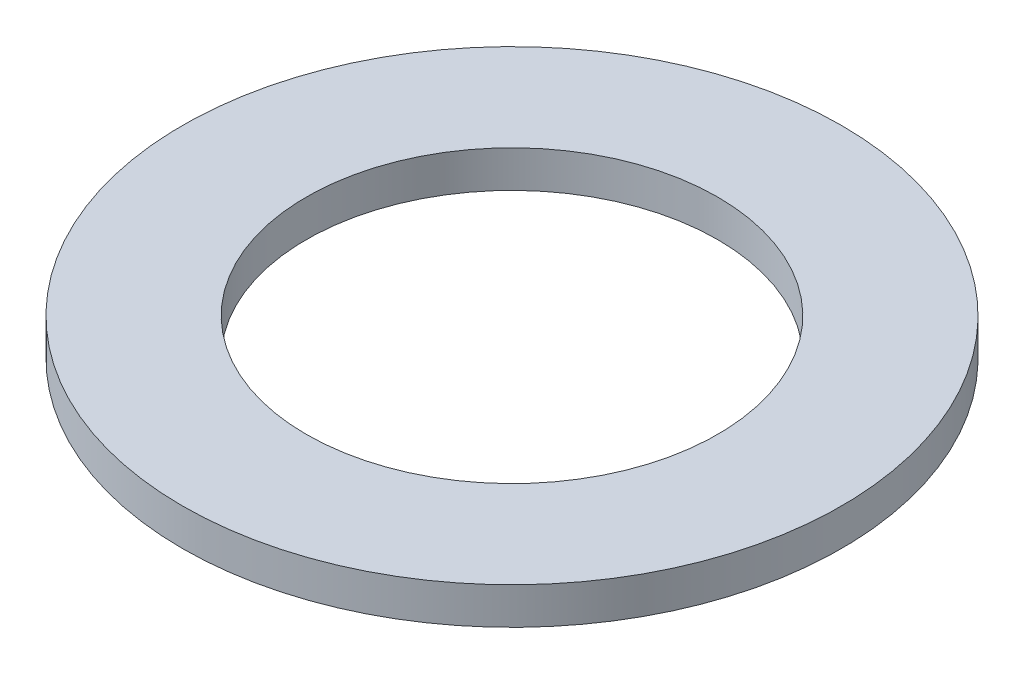
ISO-10303-21;
HEADER;
FILE_DESCRIPTION(('STEP AP214'),'2;1');
FILE_NAME('part.step','',(''),(''),'','','');
FILE_SCHEMA(('AUTOMOTIVE_DESIGN { 1 0 10303 214 1 1 1 1 }'));
ENDSEC;
DATA;
#1=APPLICATION_CONTEXT('core data for automotive mechanical design processes');
#2=APPLICATION_PROTOCOL_DEFINITION('international standard','automotive_design',2000,#1);
#3=PRODUCT_CONTEXT('',#1,'mechanical');
#4=PRODUCT('Part','Part','',(#3));
#5=PRODUCT_RELATED_PRODUCT_CATEGORY('part','',(#4));
#6=PRODUCT_DEFINITION_FORMATION('','',#4);
#7=PRODUCT_DEFINITION_CONTEXT('part definition',#1,'design');
#8=PRODUCT_DEFINITION('design','',#6,#7);
#9=PRODUCT_DEFINITION_SHAPE('','',#8);
#10=(LENGTH_UNIT() NAMED_UNIT(*) SI_UNIT(.MILLI.,.METRE.));
#11=(NAMED_UNIT(*) PLANE_ANGLE_UNIT() SI_UNIT($,.RADIAN.));
#12=(NAMED_UNIT(*) SI_UNIT($,.STERADIAN.) SOLID_ANGLE_UNIT());
#13=UNCERTAINTY_MEASURE_WITH_UNIT(LENGTH_MEASURE(1.E-05),#10,'distance_accuracy_value','');
#14=(GEOMETRIC_REPRESENTATION_CONTEXT(3) GLOBAL_UNCERTAINTY_ASSIGNED_CONTEXT((#13)) GLOBAL_UNIT_ASSIGNED_CONTEXT((#10,
#11,#12)) REPRESENTATION_CONTEXT('',''));
#15=CARTESIAN_POINT('',(0.,0.,0.));
#16=DIRECTION('',(0.,0.,1.));
#17=DIRECTION('',(1.,0.,0.));
#18=AXIS2_PLACEMENT_3D('',#15,#16,#17);
#19=CARTESIAN_POINT('',(0.,0.889,0.));
#20=DIRECTION('',(0.,-1.,0.));
#21=DIRECTION('',(0.,0.,-1.));
#22=AXIS2_PLACEMENT_3D('',#19,#20,#21);
#23=CYLINDRICAL_SURFACE('',#22,7.9375);
#24=CARTESIAN_POINT('',(0.,0.889,0.));
#25=DIRECTION('',(0.,1.,0.));
#26=DIRECTION('',(0.,0.,1.));
#27=AXIS2_PLACEMENT_3D('',#24,#25,#26);
#28=CIRCLE('',#27,7.9375);
#29=CARTESIAN_POINT('',(0.,0.889,7.9375));
#30=VERTEX_POINT('',#29);
#31=EDGE_CURVE('E10',#30,#30,#28,.T.);
#32=ORIENTED_EDGE('',*,*,#31,.F.);
#33=EDGE_LOOP('',(#32));
#34=FACE_BOUND('',#33,.T.);
#35=CARTESIAN_POINT('',(0.,0.,0.));
#36=DIRECTION('',(0.,1.,0.));
#37=DIRECTION('',(0.,0.,1.));
#38=AXIS2_PLACEMENT_3D('',#35,#36,#37);
#39=CIRCLE('',#38,7.9375);
#40=CARTESIAN_POINT('',(0.,0.,7.9375));
#41=VERTEX_POINT('',#40);
#42=EDGE_CURVE('E35',#41,#41,#39,.T.);
#43=ORIENTED_EDGE('',*,*,#42,.T.);
#44=EDGE_LOOP('',(#43));
#45=FACE_BOUND('',#44,.T.);
#46=ADVANCED_FACE('F32',(#34,#45),#23,.T.);
#47=CARTESIAN_POINT('',(0.,0.889,0.));
#48=DIRECTION('',(0.,1.,0.));
#49=DIRECTION('',(0.,0.,1.));
#50=AXIS2_PLACEMENT_3D('',#47,#48,#49);
#51=PLANE('',#50);
#52=CARTESIAN_POINT('',(0.,0.889,0.));
#53=DIRECTION('',(0.,1.,0.));
#54=DIRECTION('',(0.,0.,1.));
#55=AXIS2_PLACEMENT_3D('',#52,#53,#54);
#56=CIRCLE('',#55,4.953);
#57=CARTESIAN_POINT('',(0.,0.889,4.953));
#58=VERTEX_POINT('',#57);
#59=EDGE_CURVE('E44',#58,#58,#56,.T.);
#60=ORIENTED_EDGE('',*,*,#59,.F.);
#61=EDGE_LOOP('',(#60));
#62=FACE_BOUND('',#61,.T.);
#63=ORIENTED_EDGE('',*,*,#31,.T.);
#64=EDGE_LOOP('',(#63));
#65=FACE_BOUND('',#64,.T.);
#66=ADVANCED_FACE('F59',(#62,#65),#51,.T.);
#67=CARTESIAN_POINT('',(0.,0.,0.));
#68=DIRECTION('',(0.,1.,0.));
#69=DIRECTION('',(0.,0.,1.));
#70=AXIS2_PLACEMENT_3D('',#67,#68,#69);
#71=PLANE('',#70);
#72=CARTESIAN_POINT('',(0.,0.,0.));
#73=DIRECTION('',(0.,1.,0.));
#74=DIRECTION('',(0.,0.,1.));
#75=AXIS2_PLACEMENT_3D('',#72,#73,#74);
#76=CIRCLE('',#75,4.953);
#77=CARTESIAN_POINT('',(0.,0.,4.953));
#78=VERTEX_POINT('',#77);
#79=EDGE_CURVE('E42',#78,#78,#76,.T.);
#80=ORIENTED_EDGE('',*,*,#79,.T.);
#81=EDGE_LOOP('',(#80));
#82=FACE_BOUND('',#81,.T.);
#83=ORIENTED_EDGE('',*,*,#42,.F.);
#84=EDGE_LOOP('',(#83));
#85=FACE_BOUND('',#84,.T.);
#86=ADVANCED_FACE('F50',(#82,#85),#71,.F.);
#87=CARTESIAN_POINT('',(0.,0.,0.));
#88=DIRECTION('',(0.,1.,0.));
#89=DIRECTION('',(0.,0.,1.));
#90=AXIS2_PLACEMENT_3D('',#87,#88,#89);
#91=CYLINDRICAL_SURFACE('',#90,4.953);
#92=ORIENTED_EDGE('',*,*,#79,.F.);
#93=EDGE_LOOP('',(#92));
#94=FACE_BOUND('',#93,.T.);
#95=ORIENTED_EDGE('',*,*,#59,.T.);
#96=EDGE_LOOP('',(#95));
#97=FACE_BOUND('',#96,.T.);
#98=ADVANCED_FACE('F53',(#94,#97),#91,.F.);
#99=CLOSED_SHELL('',(#46,#66,#86,#98));
#100=MANIFOLD_SOLID_BREP('B2',#99);
#101=ADVANCED_BREP_SHAPE_REPRESENTATION('',(#18,#100),#14);
#102=SHAPE_DEFINITION_REPRESENTATION(#9,#101);
ENDSEC;
END-ISO-10303-21;
